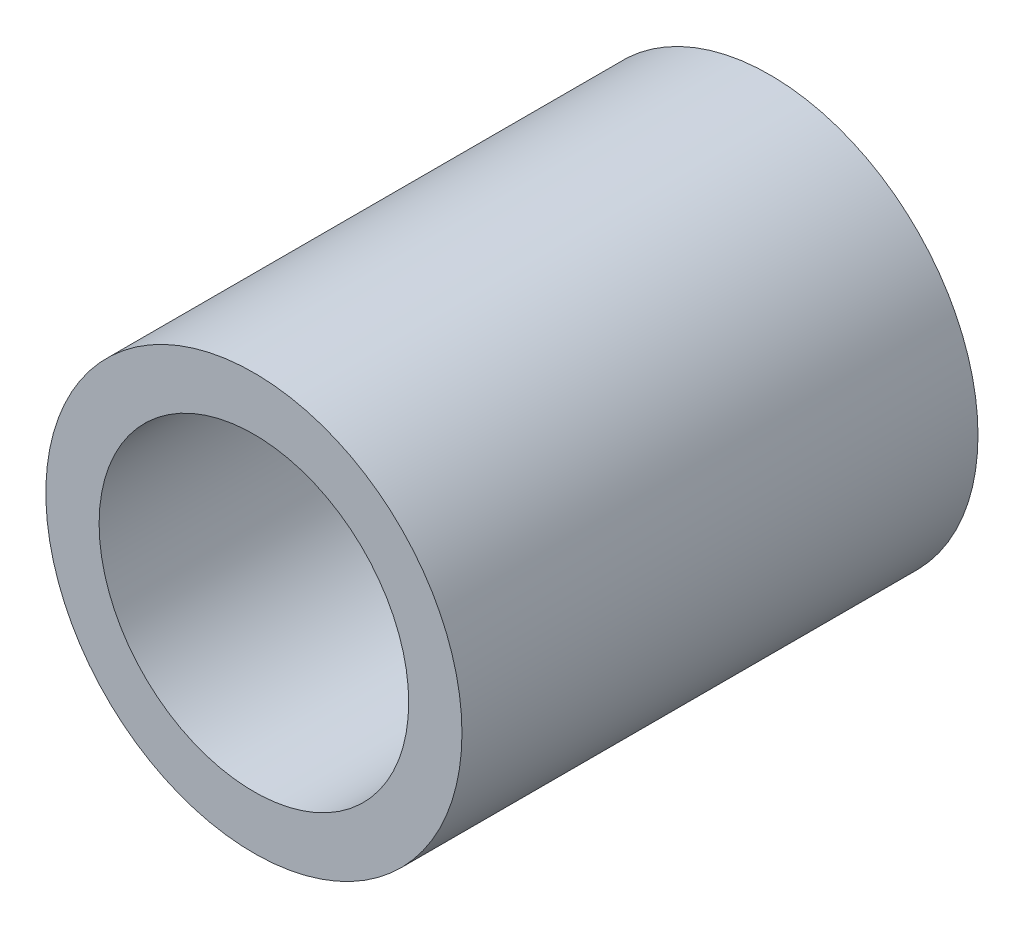
ISO-10303-21;
HEADER;
FILE_DESCRIPTION(('STEP AP214'),'2;1');
FILE_NAME('part.step','',(''),(''),'','','');
FILE_SCHEMA(('AUTOMOTIVE_DESIGN { 1 0 10303 214 1 1 1 1 }'));
ENDSEC;
DATA;
#1=APPLICATION_CONTEXT('core data for automotive mechanical design processes');
#2=APPLICATION_PROTOCOL_DEFINITION('international standard','automotive_design',2000,#1);
#3=PRODUCT_CONTEXT('',#1,'mechanical');
#4=PRODUCT('Part','Part','',(#3));
#5=PRODUCT_RELATED_PRODUCT_CATEGORY('part','',(#4));
#6=PRODUCT_DEFINITION_FORMATION('','',#4);
#7=PRODUCT_DEFINITION_CONTEXT('part definition',#1,'design');
#8=PRODUCT_DEFINITION('design','',#6,#7);
#9=PRODUCT_DEFINITION_SHAPE('','',#8);
#10=(LENGTH_UNIT() NAMED_UNIT(*) SI_UNIT(.MILLI.,.METRE.));
#11=(NAMED_UNIT(*) PLANE_ANGLE_UNIT() SI_UNIT($,.RADIAN.));
#12=(NAMED_UNIT(*) SI_UNIT($,.STERADIAN.) SOLID_ANGLE_UNIT());
#13=UNCERTAINTY_MEASURE_WITH_UNIT(LENGTH_MEASURE(1.E-05),#10,'distance_accuracy_value','');
#14=(GEOMETRIC_REPRESENTATION_CONTEXT(3) GLOBAL_UNCERTAINTY_ASSIGNED_CONTEXT((#13)) GLOBAL_UNIT_ASSIGNED_CONTEXT((#10,
#11,#12)) REPRESENTATION_CONTEXT('',''));
#15=CARTESIAN_POINT('',(0.,0.,0.));
#16=DIRECTION('',(0.,0.,1.));
#17=DIRECTION('',(1.,0.,0.));
#18=AXIS2_PLACEMENT_3D('',#15,#16,#17);
#19=CARTESIAN_POINT('',(0.,0.,3.96875));
#20=DIRECTION('',(0.,0.,1.));
#21=DIRECTION('',(1.,0.,0.));
#22=AXIS2_PLACEMENT_3D('',#19,#20,#21);
#23=PLANE('',#22);
#24=CARTESIAN_POINT('',(0.,0.,3.96875));
#25=DIRECTION('',(0.,0.,1.));
#26=DIRECTION('',(1.,0.,0.));
#27=AXIS2_PLACEMENT_3D('',#24,#25,#26);
#28=CIRCLE('',#27,3.2004);
#29=CARTESIAN_POINT('',(3.2004,0.,3.96875));
#30=VERTEX_POINT('',#29);
#31=EDGE_CURVE('E10',#30,#30,#28,.T.);
#32=ORIENTED_EDGE('',*,*,#31,.T.);
#33=EDGE_LOOP('',(#32));
#34=FACE_BOUND('',#33,.T.);
#35=CARTESIAN_POINT('',(0.,0.,3.96875));
#36=DIRECTION('',(0.,0.,1.));
#37=DIRECTION('',(1.,0.,0.));
#38=AXIS2_PLACEMENT_3D('',#35,#36,#37);
#39=CIRCLE('',#38,2.38125);
#40=CARTESIAN_POINT('',(2.38125,0.,3.96875));
#41=VERTEX_POINT('',#40);
#42=EDGE_CURVE('E53',#41,#41,#39,.T.);
#43=ORIENTED_EDGE('',*,*,#42,.F.);
#44=EDGE_LOOP('',(#43));
#45=FACE_BOUND('',#44,.T.);
#46=ADVANCED_FACE('F39',(#34,#45),#23,.T.);
#47=CARTESIAN_POINT('',(0.,0.,-3.96875));
#48=DIRECTION('',(0.,0.,1.));
#49=DIRECTION('',(1.,0.,0.));
#50=AXIS2_PLACEMENT_3D('',#47,#48,#49);
#51=PLANE('',#50);
#52=CARTESIAN_POINT('',(0.,0.,-3.96875));
#53=DIRECTION('',(0.,0.,1.));
#54=DIRECTION('',(1.,0.,0.));
#55=AXIS2_PLACEMENT_3D('',#52,#53,#54);
#56=CIRCLE('',#55,3.2004);
#57=CARTESIAN_POINT('',(3.2004,0.,-3.96875));
#58=VERTEX_POINT('',#57);
#59=EDGE_CURVE('E43',#58,#58,#56,.T.);
#60=ORIENTED_EDGE('',*,*,#59,.F.);
#61=EDGE_LOOP('',(#60));
#62=FACE_BOUND('',#61,.T.);
#63=CARTESIAN_POINT('',(0.,0.,-3.96875));
#64=DIRECTION('',(0.,0.,1.));
#65=DIRECTION('',(1.,0.,0.));
#66=AXIS2_PLACEMENT_3D('',#63,#64,#65);
#67=CIRCLE('',#66,2.38125);
#68=CARTESIAN_POINT('',(2.38125,0.,-3.96875));
#69=VERTEX_POINT('',#68);
#70=EDGE_CURVE('E55',#69,#69,#67,.T.);
#71=ORIENTED_EDGE('',*,*,#70,.T.);
#72=EDGE_LOOP('',(#71));
#73=FACE_BOUND('',#72,.T.);
#74=ADVANCED_FACE('F66',(#62,#73),#51,.F.);
#75=CARTESIAN_POINT('',(0.,0.,3.96875));
#76=DIRECTION('',(0.,0.,-1.));
#77=DIRECTION('',(-1.,0.,0.));
#78=AXIS2_PLACEMENT_3D('',#75,#76,#77);
#79=CYLINDRICAL_SURFACE('',#78,3.2004);
#80=ORIENTED_EDGE('',*,*,#31,.F.);
#81=EDGE_LOOP('',(#80));
#82=FACE_BOUND('',#81,.T.);
#83=ORIENTED_EDGE('',*,*,#59,.T.);
#84=EDGE_LOOP('',(#83));
#85=FACE_BOUND('',#84,.T.);
#86=ADVANCED_FACE('F41',(#82,#85),#79,.T.);
#87=CARTESIAN_POINT('',(0.,0.,3.96875));
#88=DIRECTION('',(0.,0.,-1.));
#89=DIRECTION('',(-1.,0.,0.));
#90=AXIS2_PLACEMENT_3D('',#87,#88,#89);
#91=CYLINDRICAL_SURFACE('',#90,2.38125);
#92=ORIENTED_EDGE('',*,*,#42,.T.);
#93=EDGE_LOOP('',(#92));
#94=FACE_BOUND('',#93,.T.);
#95=ORIENTED_EDGE('',*,*,#70,.F.);
#96=EDGE_LOOP('',(#95));
#97=FACE_BOUND('',#96,.T.);
#98=ADVANCED_FACE('F62',(#94,#97),#91,.F.);
#99=CLOSED_SHELL('',(#46,#74,#86,#98));
#100=MANIFOLD_SOLID_BREP('B2',#99);
#101=ADVANCED_BREP_SHAPE_REPRESENTATION('',(#18,#100),#14);
#102=SHAPE_DEFINITION_REPRESENTATION(#9,#101);
ENDSEC;
END-ISO-10303-21;
